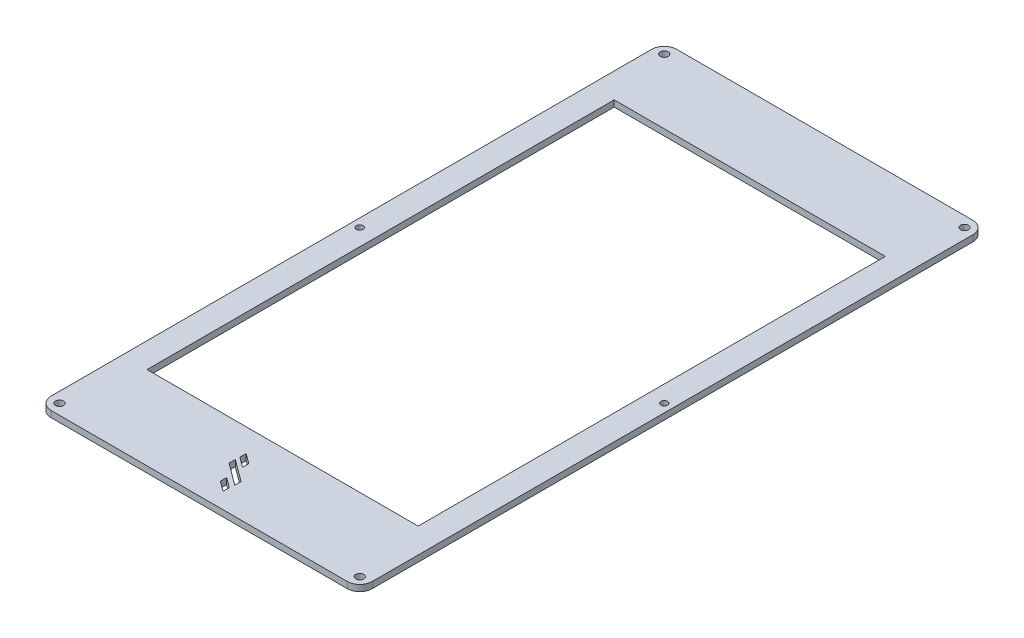
ISO-10303-21;
HEADER;
FILE_DESCRIPTION(('STEP AP214'),'2;1');
FILE_NAME('part.step','',(''),(''),'','','');
FILE_SCHEMA(('AUTOMOTIVE_DESIGN { 1 0 10303 214 1 1 1 1 }'));
ENDSEC;
DATA;
#1=APPLICATION_CONTEXT('core data for automotive mechanical design processes');
#2=APPLICATION_PROTOCOL_DEFINITION('international standard','automotive_design',2000,#1);
#3=PRODUCT_CONTEXT('',#1,'mechanical');
#4=PRODUCT('Part','Part','',(#3));
#5=PRODUCT_RELATED_PRODUCT_CATEGORY('part','',(#4));
#6=PRODUCT_DEFINITION_FORMATION('','',#4);
#7=PRODUCT_DEFINITION_CONTEXT('part definition',#1,'design');
#8=PRODUCT_DEFINITION('design','',#6,#7);
#9=PRODUCT_DEFINITION_SHAPE('','',#8);
#10=(LENGTH_UNIT() NAMED_UNIT(*) SI_UNIT(.MILLI.,.METRE.));
#11=(NAMED_UNIT(*) PLANE_ANGLE_UNIT() SI_UNIT($,.RADIAN.));
#12=(NAMED_UNIT(*) SI_UNIT($,.STERADIAN.) SOLID_ANGLE_UNIT());
#13=UNCERTAINTY_MEASURE_WITH_UNIT(LENGTH_MEASURE(1.E-05),#10,'distance_accuracy_value','');
#14=(GEOMETRIC_REPRESENTATION_CONTEXT(3) GLOBAL_UNCERTAINTY_ASSIGNED_CONTEXT((#13)) GLOBAL_UNIT_ASSIGNED_CONTEXT((#10,
#11,#12)) REPRESENTATION_CONTEXT('',''));
#15=CARTESIAN_POINT('',(0.,0.,0.));
#16=DIRECTION('',(0.,0.,1.));
#17=DIRECTION('',(1.,0.,0.));
#18=AXIS2_PLACEMENT_3D('',#15,#16,#17);
#19=CARTESIAN_POINT('',(-47.898387779286,-1.5,-1317.71353119356));
#20=DIRECTION('',(0.,-1.,0.));
#21=DIRECTION('',(0.,0.,-1.));
#22=AXIS2_PLACEMENT_3D('',#19,#20,#21);
#23=PLANE('',#22);
#24=CARTESIAN_POINT('',(-46.898387779286,-1.5,-1389.71353119356));
#25=DIRECTION('',(0.,-1.,0.));
#26=DIRECTION('',(0.,0.,-1.));
#27=AXIS2_PLACEMENT_3D('',#24,#25,#26);
#28=CIRCLE('',#27,0.799999999999977);
#29=CARTESIAN_POINT('',(-46.898387779286,-1.5,-1390.51353119356));
#30=VERTEX_POINT('',#29);
#31=EDGE_CURVE('E580',#30,#30,#28,.T.);
#32=ORIENTED_EDGE('',*,*,#31,.F.);
#33=EDGE_LOOP('',(#32));
#34=FACE_BOUND('',#33,.T.);
#35=CARTESIAN_POINT('',(-119.898387779286,-1.5,-1389.71353119356));
#36=DIRECTION('',(0.,-1.,0.));
#37=DIRECTION('',(0.,0.,1.));
#38=AXIS2_PLACEMENT_3D('',#35,#36,#37);
#39=CIRCLE('',#38,0.799999999999983);
#40=CARTESIAN_POINT('',(-119.898387779286,-1.5,-1388.91353119356));
#41=VERTEX_POINT('',#40);
#42=EDGE_CURVE('E584',#41,#41,#39,.T.);
#43=ORIENTED_EDGE('',*,*,#42,.F.);
#44=EDGE_LOOP('',(#43));
#45=FACE_BOUND('',#44,.T.);
#46=DIRECTION('',(0.,0.,-1.));
#47=VECTOR('',#46,1.);
#48=CARTESIAN_POINT('',(-50.898387779286,-1.5,-1332.71353119356));
#49=LINE('',#48,#47);
#50=CARTESIAN_POINT('',(-50.898387779286,-1.5,-1334.71353119356));
#51=VERTEX_POINT('',#50);
#52=CARTESIAN_POINT('',(-50.898387779286,-1.5,-1446.71353119356));
#53=VERTEX_POINT('',#52);
#54=EDGE_CURVE('E326',#51,#53,#49,.T.);
#55=ORIENTED_EDGE('',*,*,#54,.T.);
#56=DIRECTION('',(-1.,0.,0.));
#57=VECTOR('',#56,1.);
#58=CARTESIAN_POINT('',(-50.898387779286,-1.5,-1446.71353119356));
#59=LINE('',#58,#57);
#60=CARTESIAN_POINT('',(-115.898387779286,-1.5,-1446.71353119356));
#61=VERTEX_POINT('',#60);
#62=EDGE_CURVE('E227',#53,#61,#59,.T.);
#63=ORIENTED_EDGE('',*,*,#62,.T.);
#64=DIRECTION('',(0.,0.,-1.));
#65=VECTOR('',#64,1.);
#66=CARTESIAN_POINT('',(-115.898387779286,-1.5,-1332.71353119356));
#67=LINE('',#66,#65);
#68=CARTESIAN_POINT('',(-115.898387779286,-1.5,-1334.71353119356));
#69=VERTEX_POINT('',#68);
#70=EDGE_CURVE('E207',#69,#61,#67,.T.);
#71=ORIENTED_EDGE('',*,*,#70,.F.);
#72=DIRECTION('',(1.,0.,0.));
#73=VECTOR('',#72,1.);
#74=CARTESIAN_POINT('',(-50.898387779286,-1.5,-1334.71353119356));
#75=LINE('',#74,#73);
#76=EDGE_CURVE('E218',#69,#51,#75,.T.);
#77=ORIENTED_EDGE('',*,*,#76,.T.);
#78=EDGE_LOOP('',(#55,#63,#71,#77));
#79=FACE_BOUND('',#78,.T.);
#80=DIRECTION('',(-0.804048076479919,0.,-0.59456428643919));
#81=VECTOR('',#80,1.);
#82=CARTESIAN_POINT('',(-81.3637610941643,-1.5,-1321.20817562095));
#83=LINE('',#82,#81);
#84=CARTESIAN_POINT('',(-81.3637610941643,-1.5,-1321.20817562095));
#85=VERTEX_POINT('',#84);
#86=CARTESIAN_POINT('',(-86.6379108061744,-1.5,-1325.10821736202));
#87=VERTEX_POINT('',#86);
#88=EDGE_CURVE('E262',#85,#87,#83,.T.);
#89=ORIENTED_EDGE('',*,*,#88,.F.);
#90=DIRECTION('',(0.,0.,1.));
#91=VECTOR('',#90,1.);
#92=CARTESIAN_POINT('',(-81.3637610941643,-1.5,-1321.20817562095));
#93=LINE('',#92,#91);
#94=CARTESIAN_POINT('',(-81.3637610941643,-1.5,-1322.70950719552));
#95=VERTEX_POINT('',#94);
#96=EDGE_CURVE('E273',#95,#85,#93,.T.);
#97=ORIENTED_EDGE('',*,*,#96,.F.);
#98=DIRECTION('',(0.804048076479919,0.,0.59456428643919));
#99=VECTOR('',#98,1.);
#100=CARTESIAN_POINT('',(-81.3637610941643,-1.5,-1322.70950719552));
#101=LINE('',#100,#99);
#102=CARTESIAN_POINT('',(-86.6379108061744,-1.5,-1326.60954893659));
#103=VERTEX_POINT('',#102);
#104=EDGE_CURVE('E287',#103,#95,#101,.T.);
#105=ORIENTED_EDGE('',*,*,#104,.F.);
#106=DIRECTION('',(0.,0.,-1.));
#107=VECTOR('',#106,1.);
#108=CARTESIAN_POINT('',(-86.6379108061744,-1.5,-1325.10821736202));
#109=LINE('',#108,#107);
#110=EDGE_CURVE('E284',#87,#103,#109,.T.);
#111=ORIENTED_EDGE('',*,*,#110,.F.);
#112=EDGE_LOOP('',(#89,#97,#105,#111));
#113=FACE_BOUND('',#112,.T.);
#114=DIRECTION('',(-0.804048076479919,0.,-0.59456428643919));
#115=VECTOR('',#114,1.);
#116=CARTESIAN_POINT('',(-81.5204459504745,-1.5,-1318.54750988359));
#117=LINE('',#116,#115);
#118=CARTESIAN_POINT('',(-81.5204459504745,-1.5,-1318.54750988359));
#119=VERTEX_POINT('',#118);
#120=CARTESIAN_POINT('',(-83.9378842629742,-1.5,-1320.33511752463));
#121=VERTEX_POINT('',#120);
#122=EDGE_CURVE('E231',#119,#121,#117,.T.);
#123=ORIENTED_EDGE('',*,*,#122,.F.);
#124=DIRECTION('',(0.,0.,1.));
#125=VECTOR('',#124,1.);
#126=CARTESIAN_POINT('',(-81.5204459504745,-1.5,-1318.54750988359));
#127=LINE('',#126,#125);
#128=CARTESIAN_POINT('',(-81.5204459504745,-1.5,-1320.04884145816));
#129=VERTEX_POINT('',#128);
#130=EDGE_CURVE('E241',#129,#119,#127,.T.);
#131=ORIENTED_EDGE('',*,*,#130,.F.);
#132=DIRECTION('',(0.804048076479919,0.,0.59456428643919));
#133=VECTOR('',#132,1.);
#134=CARTESIAN_POINT('',(-81.5204459504745,-1.5,-1320.04884145816));
#135=LINE('',#134,#133);
#136=CARTESIAN_POINT('',(-83.9378842629742,-1.5,-1321.8364490992));
#137=VERTEX_POINT('',#136);
#138=EDGE_CURVE('E255',#137,#129,#135,.T.);
#139=ORIENTED_EDGE('',*,*,#138,.F.);
#140=DIRECTION('',(0.,0.,-1.));
#141=VECTOR('',#140,1.);
#142=CARTESIAN_POINT('',(-83.9378842629742,-1.5,-1320.33511752463));
#143=LINE('',#142,#141);
#144=EDGE_CURVE('E252',#121,#137,#143,.T.);
#145=ORIENTED_EDGE('',*,*,#144,.F.);
#146=EDGE_LOOP('',(#123,#131,#139,#145));
#147=FACE_BOUND('',#146,.T.);
#148=DIRECTION('',(-0.804048076479919,0.,-0.59456428643919));
#149=VECTOR('',#148,1.);
#150=CARTESIAN_POINT('',(-84.1532513743159,-1.5,-1325.85263282658));
#151=LINE('',#150,#149);
#152=CARTESIAN_POINT('',(-84.1532513743159,-1.5,-1325.85263282658));
#153=VERTEX_POINT('',#152);
#154=CARTESIAN_POINT('',(-86.5706896868156,-1.5,-1327.64024046762));
#155=VERTEX_POINT('',#154);
#156=EDGE_CURVE('E294',#153,#155,#151,.T.);
#157=ORIENTED_EDGE('',*,*,#156,.F.);
#158=DIRECTION('',(0.,0.,1.));
#159=VECTOR('',#158,1.);
#160=CARTESIAN_POINT('',(-84.1532513743159,-1.5,-1325.85263282658));
#161=LINE('',#160,#159);
#162=CARTESIAN_POINT('',(-84.1532513743159,-1.5,-1327.35396440115));
#163=VERTEX_POINT('',#162);
#164=EDGE_CURVE('E305',#163,#153,#161,.T.);
#165=ORIENTED_EDGE('',*,*,#164,.F.);
#166=DIRECTION('',(0.804048076479919,0.,0.59456428643919));
#167=VECTOR('',#166,1.);
#168=CARTESIAN_POINT('',(-84.1532513743159,-1.5,-1327.35396440115));
#169=LINE('',#168,#167);
#170=CARTESIAN_POINT('',(-86.5706896868156,-1.5,-1329.14157204219));
#171=VERTEX_POINT('',#170);
#172=EDGE_CURVE('E319',#171,#163,#169,.T.);
#173=ORIENTED_EDGE('',*,*,#172,.F.);
#174=DIRECTION('',(0.,0.,-1.));
#175=VECTOR('',#174,1.);
#176=CARTESIAN_POINT('',(-86.5706896868156,-1.5,-1327.64024046762));
#177=LINE('',#176,#175);
#178=EDGE_CURVE('E316',#155,#171,#177,.T.);
#179=ORIENTED_EDGE('',*,*,#178,.F.);
#180=EDGE_LOOP('',(#157,#165,#173,#179));
#181=FACE_BOUND('',#180,.T.);
#182=CARTESIAN_POINT('',(-47.3983877792856,-1.5,-1462.21353119356));
#183=DIRECTION('',(0.,-1.,0.));
#184=DIRECTION('',(0.,0.,-1.));
#185=AXIS2_PLACEMENT_3D('',#182,#183,#184);
#186=CIRCLE('',#185,0.950000000000017);
#187=CARTESIAN_POINT('',(-47.3983877792856,-1.5,-1463.16353119356));
#188=VERTEX_POINT('',#187);
#189=EDGE_CURVE('E372',#188,#188,#186,.T.);
#190=ORIENTED_EDGE('',*,*,#189,.F.);
#191=EDGE_LOOP('',(#190));
#192=FACE_BOUND('',#191,.T.);
#193=CARTESIAN_POINT('',(-119.398387779286,-1.5,-1462.21353119356));
#194=DIRECTION('',(0.,-1.,0.));
#195=DIRECTION('',(0.,0.,-1.));
#196=AXIS2_PLACEMENT_3D('',#193,#194,#195);
#197=CIRCLE('',#196,0.950000000000011);
#198=CARTESIAN_POINT('',(-119.398387779286,-1.5,-1463.16353119356));
#199=VERTEX_POINT('',#198);
#200=EDGE_CURVE('E378',#199,#199,#197,.T.);
#201=ORIENTED_EDGE('',*,*,#200,.F.);
#202=EDGE_LOOP('',(#201));
#203=FACE_BOUND('',#202,.T.);
#204=CARTESIAN_POINT('',(-47.898387779286,-1.5,-1317.71353119356));
#205=DIRECTION('',(0.,-1.,0.));
#206=DIRECTION('',(0.,0.,-1.));
#207=AXIS2_PLACEMENT_3D('',#204,#205,#206);
#208=CIRCLE('',#207,3.00000000000009);
#209=CARTESIAN_POINT('',(-44.8983877792859,-1.5,-1317.71353119356));
#210=VERTEX_POINT('',#209);
#211=CARTESIAN_POINT('',(-47.898387779286,-1.5,-1314.71353119356));
#212=VERTEX_POINT('',#211);
#213=EDGE_CURVE('E381',#210,#212,#208,.T.);
#214=ORIENTED_EDGE('',*,*,#213,.T.);
#215=DIRECTION('',(-1.,0.,0.));
#216=VECTOR('',#215,1.);
#217=CARTESIAN_POINT('',(-47.898387779286,-1.5,-1314.71353119356));
#218=LINE('',#217,#216);
#219=CARTESIAN_POINT('',(-118.898387779286,-1.5,-1314.71353119356));
#220=VERTEX_POINT('',#219);
#221=EDGE_CURVE('E384',#212,#220,#218,.T.);
#222=ORIENTED_EDGE('',*,*,#221,.T.);
#223=CARTESIAN_POINT('',(-118.898387779286,-1.5,-1317.71353119356));
#224=DIRECTION('',(0.,-1.,0.));
#225=DIRECTION('',(0.,0.,-1.));
#226=AXIS2_PLACEMENT_3D('',#223,#224,#225);
#227=CIRCLE('',#226,3.00000000000009);
#228=CARTESIAN_POINT('',(-121.898387779286,-1.5,-1317.71353119356));
#229=VERTEX_POINT('',#228);
#230=EDGE_CURVE('E387',#220,#229,#227,.T.);
#231=ORIENTED_EDGE('',*,*,#230,.T.);
#232=DIRECTION('',(0.,0.,-1.));
#233=VECTOR('',#232,1.);
#234=CARTESIAN_POINT('',(-121.898387779286,-1.5,-1317.71353119356));
#235=LINE('',#234,#233);
#236=CARTESIAN_POINT('',(-121.898387779286,-1.5,-1461.71353119356));
#237=VERTEX_POINT('',#236);
#238=EDGE_CURVE('E390',#229,#237,#235,.T.);
#239=ORIENTED_EDGE('',*,*,#238,.T.);
#240=CARTESIAN_POINT('',(-118.898387779286,-1.5,-1461.71353119356));
#241=DIRECTION('',(0.,-1.,0.));
#242=DIRECTION('',(0.,0.,-1.));
#243=AXIS2_PLACEMENT_3D('',#240,#241,#242);
#244=CIRCLE('',#243,2.99999999999992);
#245=CARTESIAN_POINT('',(-118.898387779286,-1.5,-1464.71353119356));
#246=VERTEX_POINT('',#245);
#247=EDGE_CURVE('E393',#237,#246,#244,.T.);
#248=ORIENTED_EDGE('',*,*,#247,.T.);
#249=DIRECTION('',(1.,0.,0.));
#250=VECTOR('',#249,1.);
#251=CARTESIAN_POINT('',(-118.898387779286,-1.5,-1464.71353119356));
#252=LINE('',#251,#250);
#253=CARTESIAN_POINT('',(-47.898387779286,-1.5,-1464.71353119356));
#254=VERTEX_POINT('',#253);
#255=EDGE_CURVE('E396',#246,#254,#252,.T.);
#256=ORIENTED_EDGE('',*,*,#255,.T.);
#257=CARTESIAN_POINT('',(-47.898387779286,-1.5,-1461.71353119356));
#258=DIRECTION('',(0.,-1.,0.));
#259=DIRECTION('',(0.,0.,-1.));
#260=AXIS2_PLACEMENT_3D('',#257,#258,#259);
#261=CIRCLE('',#260,2.99999999999992);
#262=CARTESIAN_POINT('',(-44.898387779286,-1.5,-1461.71353119356));
#263=VERTEX_POINT('',#262);
#264=EDGE_CURVE('E399',#254,#263,#261,.T.);
#265=ORIENTED_EDGE('',*,*,#264,.T.);
#266=DIRECTION('',(0.,0.,1.));
#267=VECTOR('',#266,1.);
#268=CARTESIAN_POINT('',(-44.898387779286,-1.5,-1461.71353119356));
#269=LINE('',#268,#267);
#270=EDGE_CURVE('E402',#263,#210,#269,.T.);
#271=ORIENTED_EDGE('',*,*,#270,.T.);
#272=EDGE_LOOP('',(#214,#222,#231,#239,#248,#256,#265,#271));
#273=FACE_BOUND('',#272,.T.);
#274=CARTESIAN_POINT('',(-119.398387779286,-1.5,-1317.21353119356));
#275=DIRECTION('',(0.,-1.,0.));
#276=DIRECTION('',(0.,0.,-1.));
#277=AXIS2_PLACEMENT_3D('',#274,#275,#276);
#278=CIRCLE('',#277,0.950000000000011);
#279=CARTESIAN_POINT('',(-119.398387779286,-1.5,-1318.16353119356));
#280=VERTEX_POINT('',#279);
#281=EDGE_CURVE('E375',#280,#280,#278,.T.);
#282=ORIENTED_EDGE('',*,*,#281,.F.);
#283=EDGE_LOOP('',(#282));
#284=FACE_BOUND('',#283,.T.);
#285=CARTESIAN_POINT('',(-47.398387779286,-1.5,-1317.21353119356));
#286=DIRECTION('',(0.,-1.,0.));
#287=DIRECTION('',(0.,0.,-1.));
#288=AXIS2_PLACEMENT_3D('',#285,#286,#287);
#289=CIRCLE('',#288,0.950000000000017);
#290=CARTESIAN_POINT('',(-47.398387779286,-1.5,-1318.16353119356));
#291=VERTEX_POINT('',#290);
#292=EDGE_CURVE('E369',#291,#291,#289,.T.);
#293=ORIENTED_EDGE('',*,*,#292,.F.);
#294=EDGE_LOOP('',(#293));
#295=FACE_BOUND('',#294,.T.);
#296=ADVANCED_FACE('F38',(#34,#45,#79,#113,#147,#181,#192,#203,#273,#284,#295),#23,.T.);
#297=CARTESIAN_POINT('',(-47.898387779286,0.,-1317.71353119356));
#298=DIRECTION('',(0.,-1.,0.));
#299=DIRECTION('',(0.,0.,-1.));
#300=AXIS2_PLACEMENT_3D('',#297,#298,#299);
#301=PLANE('',#300);
#302=CARTESIAN_POINT('',(-46.898387779286,0.,-1389.71353119356));
#303=DIRECTION('',(0.,-1.,0.));
#304=DIRECTION('',(0.,0.,-1.));
#305=AXIS2_PLACEMENT_3D('',#302,#303,#304);
#306=CIRCLE('',#305,0.799999999999977);
#307=CARTESIAN_POINT('',(-46.898387779286,0.,-1390.51353119356));
#308=VERTEX_POINT('',#307);
#309=EDGE_CURVE('E228',#308,#308,#306,.F.);
#310=ORIENTED_EDGE('',*,*,#309,.F.);
#311=EDGE_LOOP('',(#310));
#312=FACE_BOUND('',#311,.T.);
#313=CARTESIAN_POINT('',(-119.898387779286,0.,-1389.71353119356));
#314=DIRECTION('',(0.,-1.,0.));
#315=DIRECTION('',(0.,0.,-1.));
#316=AXIS2_PLACEMENT_3D('',#313,#314,#315);
#317=CIRCLE('',#316,0.799999999999983);
#318=CARTESIAN_POINT('',(-119.898387779286,0.,-1390.51353119356));
#319=VERTEX_POINT('',#318);
#320=EDGE_CURVE('E225',#319,#319,#317,.F.);
#321=ORIENTED_EDGE('',*,*,#320,.F.);
#322=EDGE_LOOP('',(#321));
#323=FACE_BOUND('',#322,.T.);
#324=DIRECTION('',(1.,0.,0.));
#325=VECTOR('',#324,1.);
#326=CARTESIAN_POINT('',(-50.898387779286,0.,-1446.71353119356));
#327=LINE('',#326,#325);
#328=CARTESIAN_POINT('',(-115.898387779286,0.,-1446.71353119356));
#329=VERTEX_POINT('',#328);
#330=CARTESIAN_POINT('',(-50.898387779286,0.,-1446.71353119356));
#331=VERTEX_POINT('',#330);
#332=EDGE_CURVE('E202',#329,#331,#327,.T.);
#333=ORIENTED_EDGE('',*,*,#332,.T.);
#334=DIRECTION('',(0.,0.,1.));
#335=VECTOR('',#334,1.);
#336=CARTESIAN_POINT('',(-50.898387779286,0.,-1332.71353119356));
#337=LINE('',#336,#335);
#338=CARTESIAN_POINT('',(-50.898387779286,0.,-1334.71353119356));
#339=VERTEX_POINT('',#338);
#340=EDGE_CURVE('E59',#331,#339,#337,.T.);
#341=ORIENTED_EDGE('',*,*,#340,.T.);
#342=DIRECTION('',(-1.,0.,0.));
#343=VECTOR('',#342,1.);
#344=CARTESIAN_POINT('',(-50.898387779286,0.,-1334.71353119356));
#345=LINE('',#344,#343);
#346=CARTESIAN_POINT('',(-115.898387779286,0.,-1334.71353119356));
#347=VERTEX_POINT('',#346);
#348=EDGE_CURVE('E204',#339,#347,#345,.T.);
#349=ORIENTED_EDGE('',*,*,#348,.T.);
#350=DIRECTION('',(0.,0.,1.));
#351=VECTOR('',#350,1.);
#352=CARTESIAN_POINT('',(-115.898387779286,0.,-1332.71353119356));
#353=LINE('',#352,#351);
#354=EDGE_CURVE('E197',#329,#347,#353,.T.);
#355=ORIENTED_EDGE('',*,*,#354,.F.);
#356=EDGE_LOOP('',(#333,#341,#349,#355));
#357=FACE_BOUND('',#356,.T.);
#358=DIRECTION('',(0.,0.,1.));
#359=VECTOR('',#358,1.);
#360=CARTESIAN_POINT('',(-81.3637610941643,0.,-1321.20817562095));
#361=LINE('',#360,#359);
#362=CARTESIAN_POINT('',(-81.3637610941643,0.,-1322.70950719552));
#363=VERTEX_POINT('',#362);
#364=CARTESIAN_POINT('',(-81.3637610941643,0.,-1321.20817562095));
#365=VERTEX_POINT('',#364);
#366=EDGE_CURVE('E279',#363,#365,#361,.T.);
#367=ORIENTED_EDGE('',*,*,#366,.T.);
#368=DIRECTION('',(-0.804048076479919,0.,-0.59456428643919));
#369=VECTOR('',#368,1.);
#370=CARTESIAN_POINT('',(-81.3637610941643,0.,-1321.20817562095));
#371=LINE('',#370,#369);
#372=CARTESIAN_POINT('',(-86.6379108061744,0.,-1325.10821736202));
#373=VERTEX_POINT('',#372);
#374=EDGE_CURVE('E269',#365,#373,#371,.T.);
#375=ORIENTED_EDGE('',*,*,#374,.T.);
#376=DIRECTION('',(0.,0.,-1.));
#377=VECTOR('',#376,1.);
#378=CARTESIAN_POINT('',(-86.6379108061744,0.,-1325.10821736202));
#379=LINE('',#378,#377);
#380=CARTESIAN_POINT('',(-86.6379108061744,0.,-1326.60954893659));
#381=VERTEX_POINT('',#380);
#382=EDGE_CURVE('E272',#373,#381,#379,.T.);
#383=ORIENTED_EDGE('',*,*,#382,.T.);
#384=DIRECTION('',(0.804048076479919,0.,0.59456428643919));
#385=VECTOR('',#384,1.);
#386=CARTESIAN_POINT('',(-81.3637610941643,0.,-1322.70950719552));
#387=LINE('',#386,#385);
#388=EDGE_CURVE('E276',#381,#363,#387,.T.);
#389=ORIENTED_EDGE('',*,*,#388,.T.);
#390=EDGE_LOOP('',(#367,#375,#383,#389));
#391=FACE_BOUND('',#390,.T.);
#392=DIRECTION('',(0.,0.,1.));
#393=VECTOR('',#392,1.);
#394=CARTESIAN_POINT('',(-81.5204459504745,0.,-1318.54750988359));
#395=LINE('',#394,#393);
#396=CARTESIAN_POINT('',(-81.5204459504745,0.,-1320.04884145816));
#397=VERTEX_POINT('',#396);
#398=CARTESIAN_POINT('',(-81.5204459504745,0.,-1318.54750988359));
#399=VERTEX_POINT('',#398);
#400=EDGE_CURVE('E247',#397,#399,#395,.T.);
#401=ORIENTED_EDGE('',*,*,#400,.T.);
#402=DIRECTION('',(-0.804048076479919,0.,-0.59456428643919));
#403=VECTOR('',#402,1.);
#404=CARTESIAN_POINT('',(-81.5204459504745,0.,-1318.54750988359));
#405=LINE('',#404,#403);
#406=CARTESIAN_POINT('',(-83.9378842629742,0.,-1320.33511752463));
#407=VERTEX_POINT('',#406);
#408=EDGE_CURVE('E237',#399,#407,#405,.T.);
#409=ORIENTED_EDGE('',*,*,#408,.T.);
#410=DIRECTION('',(0.,0.,-1.));
#411=VECTOR('',#410,1.);
#412=CARTESIAN_POINT('',(-83.9378842629742,0.,-1320.33511752463));
#413=LINE('',#412,#411);
#414=CARTESIAN_POINT('',(-83.9378842629742,0.,-1321.8364490992));
#415=VERTEX_POINT('',#414);
#416=EDGE_CURVE('E240',#407,#415,#413,.T.);
#417=ORIENTED_EDGE('',*,*,#416,.T.);
#418=DIRECTION('',(0.804048076479919,0.,0.59456428643919));
#419=VECTOR('',#418,1.);
#420=CARTESIAN_POINT('',(-81.5204459504745,0.,-1320.04884145816));
#421=LINE('',#420,#419);
#422=EDGE_CURVE('E244',#415,#397,#421,.T.);
#423=ORIENTED_EDGE('',*,*,#422,.T.);
#424=EDGE_LOOP('',(#401,#409,#417,#423));
#425=FACE_BOUND('',#424,.T.);
#426=DIRECTION('',(0.,0.,1.));
#427=VECTOR('',#426,1.);
#428=CARTESIAN_POINT('',(-84.1532513743159,0.,-1325.85263282658));
#429=LINE('',#428,#427);
#430=CARTESIAN_POINT('',(-84.1532513743159,0.,-1327.35396440115));
#431=VERTEX_POINT('',#430);
#432=CARTESIAN_POINT('',(-84.1532513743159,0.,-1325.85263282658));
#433=VERTEX_POINT('',#432);
#434=EDGE_CURVE('E311',#431,#433,#429,.T.);
#435=ORIENTED_EDGE('',*,*,#434,.T.);
#436=DIRECTION('',(-0.804048076479919,0.,-0.59456428643919));
#437=VECTOR('',#436,1.);
#438=CARTESIAN_POINT('',(-84.1532513743159,0.,-1325.85263282658));
#439=LINE('',#438,#437);
#440=CARTESIAN_POINT('',(-86.5706896868156,0.,-1327.64024046762));
#441=VERTEX_POINT('',#440);
#442=EDGE_CURVE('E301',#433,#441,#439,.T.);
#443=ORIENTED_EDGE('',*,*,#442,.T.);
#444=DIRECTION('',(0.,0.,-1.));
#445=VECTOR('',#444,1.);
#446=CARTESIAN_POINT('',(-86.5706896868156,0.,-1327.64024046762));
#447=LINE('',#446,#445);
#448=CARTESIAN_POINT('',(-86.5706896868156,0.,-1329.14157204219));
#449=VERTEX_POINT('',#448);
#450=EDGE_CURVE('E304',#441,#449,#447,.T.);
#451=ORIENTED_EDGE('',*,*,#450,.T.);
#452=DIRECTION('',(0.804048076479919,0.,0.59456428643919));
#453=VECTOR('',#452,1.);
#454=CARTESIAN_POINT('',(-84.1532513743159,0.,-1327.35396440115));
#455=LINE('',#454,#453);
#456=EDGE_CURVE('E308',#449,#431,#455,.T.);
#457=ORIENTED_EDGE('',*,*,#456,.T.);
#458=EDGE_LOOP('',(#435,#443,#451,#457));
#459=FACE_BOUND('',#458,.T.);
#460=DIRECTION('',(0.,0.,1.));
#461=VECTOR('',#460,1.);
#462=CARTESIAN_POINT('',(-44.898387779286,0.,-1461.71353119356));
#463=LINE('',#462,#461);
#464=CARTESIAN_POINT('',(-44.898387779286,0.,-1461.71353119356));
#465=VERTEX_POINT('',#464);
#466=CARTESIAN_POINT('',(-44.898387779286,0.,-1317.71353119356));
#467=VERTEX_POINT('',#466);
#468=EDGE_CURVE('E363',#465,#467,#463,.T.);
#469=ORIENTED_EDGE('',*,*,#468,.F.);
#470=CARTESIAN_POINT('',(-47.898387779286,0.,-1461.71353119356));
#471=DIRECTION('',(0.,-1.,0.));
#472=DIRECTION('',(0.,0.,-1.));
#473=AXIS2_PLACEMENT_3D('',#470,#471,#472);
#474=CIRCLE('',#473,2.99999999999995);
#475=CARTESIAN_POINT('',(-47.898387779286,0.,-1464.71353119356));
#476=VERTEX_POINT('',#475);
#477=EDGE_CURVE('E360',#476,#465,#474,.T.);
#478=ORIENTED_EDGE('',*,*,#477,.F.);
#479=DIRECTION('',(1.,0.,0.));
#480=VECTOR('',#479,1.);
#481=CARTESIAN_POINT('',(-118.898387779286,0.,-1464.71353119356));
#482=LINE('',#481,#480);
#483=CARTESIAN_POINT('',(-118.898387779286,0.,-1464.71353119356));
#484=VERTEX_POINT('',#483);
#485=EDGE_CURVE('E357',#484,#476,#482,.T.);
#486=ORIENTED_EDGE('',*,*,#485,.F.);
#487=CARTESIAN_POINT('',(-118.898387779286,0.,-1461.71353119356));
#488=DIRECTION('',(0.,-1.,0.));
#489=DIRECTION('',(0.,0.,-1.));
#490=AXIS2_PLACEMENT_3D('',#487,#488,#489);
#491=CIRCLE('',#490,2.99999999999995);
#492=CARTESIAN_POINT('',(-121.898387779286,0.,-1461.71353119356));
#493=VERTEX_POINT('',#492);
#494=EDGE_CURVE('E354',#493,#484,#491,.T.);
#495=ORIENTED_EDGE('',*,*,#494,.F.);
#496=DIRECTION('',(0.,0.,-1.));
#497=VECTOR('',#496,1.);
#498=CARTESIAN_POINT('',(-121.898387779286,0.,-1461.71353119356));
#499=LINE('',#498,#497);
#500=CARTESIAN_POINT('',(-121.898387779286,0.,-1317.71353119356));
#501=VERTEX_POINT('',#500);
#502=EDGE_CURVE('E351',#501,#493,#499,.T.);
#503=ORIENTED_EDGE('',*,*,#502,.F.);
#504=CARTESIAN_POINT('',(-118.898387779286,0.,-1317.71353119356));
#505=DIRECTION('',(0.,-1.,0.));
#506=DIRECTION('',(0.,0.,-1.));
#507=AXIS2_PLACEMENT_3D('',#504,#505,#506);
#508=CIRCLE('',#507,3.00000000000006);
#509=CARTESIAN_POINT('',(-118.898387779286,0.,-1314.71353119356));
#510=VERTEX_POINT('',#509);
#511=EDGE_CURVE('E348',#510,#501,#508,.T.);
#512=ORIENTED_EDGE('',*,*,#511,.F.);
#513=DIRECTION('',(-1.,0.,0.));
#514=VECTOR('',#513,1.);
#515=CARTESIAN_POINT('',(-118.898387779286,0.,-1314.71353119356));
#516=LINE('',#515,#514);
#517=CARTESIAN_POINT('',(-47.898387779286,0.,-1314.71353119356));
#518=VERTEX_POINT('',#517);
#519=EDGE_CURVE('E345',#518,#510,#516,.T.);
#520=ORIENTED_EDGE('',*,*,#519,.F.);
#521=CARTESIAN_POINT('',(-47.898387779286,0.,-1317.71353119356));
#522=DIRECTION('',(0.,-1.,0.));
#523=DIRECTION('',(0.,0.,-1.));
#524=AXIS2_PLACEMENT_3D('',#521,#522,#523);
#525=CIRCLE('',#524,3.00000000000007);
#526=EDGE_CURVE('E366',#467,#518,#525,.T.);
#527=ORIENTED_EDGE('',*,*,#526,.F.);
#528=EDGE_LOOP('',(#469,#478,#486,#495,#503,#512,#520,#527));
#529=FACE_BOUND('',#528,.T.);
#530=CARTESIAN_POINT('',(-47.3983877792856,0.,-1462.21353119356));
#531=DIRECTION('',(0.,-1.,0.));
#532=DIRECTION('',(0.,0.,-1.));
#533=AXIS2_PLACEMENT_3D('',#530,#531,#532);
#534=CIRCLE('',#533,0.950000000000031);
#535=CARTESIAN_POINT('',(-47.3983877792856,0.,-1463.16353119356));
#536=VERTEX_POINT('',#535);
#537=EDGE_CURVE('E339',#536,#536,#534,.F.);
#538=ORIENTED_EDGE('',*,*,#537,.F.);
#539=EDGE_LOOP('',(#538));
#540=FACE_BOUND('',#539,.T.);
#541=CARTESIAN_POINT('',(-119.398387779286,0.,-1317.21353119356));
#542=DIRECTION('',(0.,-1.,0.));
#543=DIRECTION('',(0.,0.,-1.));
#544=AXIS2_PLACEMENT_3D('',#541,#542,#543);
#545=CIRCLE('',#544,0.950000000000024);
#546=CARTESIAN_POINT('',(-119.398387779286,0.,-1318.16353119356));
#547=VERTEX_POINT('',#546);
#548=EDGE_CURVE('E42',#547,#547,#545,.F.);
#549=ORIENTED_EDGE('',*,*,#548,.F.);
#550=EDGE_LOOP('',(#549));
#551=FACE_BOUND('',#550,.T.);
#552=CARTESIAN_POINT('',(-47.398387779286,0.,-1317.21353119356));
#553=DIRECTION('',(0.,-1.,0.));
#554=DIRECTION('',(0.,0.,-1.));
#555=AXIS2_PLACEMENT_3D('',#552,#553,#554);
#556=CIRCLE('',#555,0.950000000000024);
#557=CARTESIAN_POINT('',(-47.398387779286,0.,-1318.16353119356));
#558=VERTEX_POINT('',#557);
#559=EDGE_CURVE('E336',#558,#558,#556,.F.);
#560=ORIENTED_EDGE('',*,*,#559,.F.);
#561=EDGE_LOOP('',(#560));
#562=FACE_BOUND('',#561,.T.);
#563=CARTESIAN_POINT('',(-119.398387779286,0.,-1462.21353119356));
#564=DIRECTION('',(0.,-1.,0.));
#565=DIRECTION('',(0.,0.,-1.));
#566=AXIS2_PLACEMENT_3D('',#563,#564,#565);
#567=CIRCLE('',#566,0.950000000000024);
#568=CARTESIAN_POINT('',(-119.398387779286,0.,-1463.16353119356));
#569=VERTEX_POINT('',#568);
#570=EDGE_CURVE('E342',#569,#569,#567,.F.);
#571=ORIENTED_EDGE('',*,*,#570,.F.);
#572=EDGE_LOOP('',(#571));
#573=FACE_BOUND('',#572,.T.);
#574=ADVANCED_FACE('F199',(#312,#323,#357,#391,#425,#459,#529,#540,#551,#562,#573),#301,.F.);
#575=CARTESIAN_POINT('',(-47.398387779286,10.,-1317.21353119356));
#576=DIRECTION('',(0.,-1.,0.));
#577=DIRECTION('',(0.,0.,-1.));
#578=AXIS2_PLACEMENT_3D('',#575,#576,#577);
#579=CYLINDRICAL_SURFACE('',#578,0.950000000000024);
#580=ORIENTED_EDGE('',*,*,#559,.T.);
#581=EDGE_LOOP('',(#580));
#582=FACE_BOUND('',#581,.T.);
#583=ORIENTED_EDGE('',*,*,#292,.T.);
#584=EDGE_LOOP('',(#583));
#585=FACE_BOUND('',#584,.T.);
#586=ADVANCED_FACE('F453',(#582,#585),#579,.F.);
#587=CARTESIAN_POINT('',(-118.898387779286,15.,-1314.71353119356));
#588=DIRECTION('',(0.,0.,-1.));
#589=DIRECTION('',(-1.,0.,0.));
#590=AXIS2_PLACEMENT_3D('',#587,#588,#589);
#591=PLANE('',#590);
#592=DIRECTION('',(0.,-1.,0.));
#593=VECTOR('',#592,1.);
#594=CARTESIAN_POINT('',(-47.898387779286,15.,-1314.71353119356));
#595=LINE('',#594,#593);
#596=EDGE_CURVE('E405',#518,#212,#595,.T.);
#597=ORIENTED_EDGE('',*,*,#596,.F.);
#598=ORIENTED_EDGE('',*,*,#519,.T.);
#599=DIRECTION('',(0.,-1.,0.));
#600=VECTOR('',#599,1.);
#601=CARTESIAN_POINT('',(-118.898387779286,15.,-1314.71353119356));
#602=LINE('',#601,#600);
#603=EDGE_CURVE('E407',#510,#220,#602,.T.);
#604=ORIENTED_EDGE('',*,*,#603,.T.);
#605=ORIENTED_EDGE('',*,*,#221,.F.);
#606=EDGE_LOOP('',(#597,#598,#604,#605));
#607=FACE_BOUND('',#606,.T.);
#608=ADVANCED_FACE('F451',(#607),#591,.F.);
#609=CARTESIAN_POINT('',(-118.898387779286,15.,-1317.71353119356));
#610=DIRECTION('',(0.,-1.,0.));
#611=DIRECTION('',(0.,0.,-1.));
#612=AXIS2_PLACEMENT_3D('',#609,#610,#611);
#613=CYLINDRICAL_SURFACE('',#612,3.00000000000006);
#614=ORIENTED_EDGE('',*,*,#603,.F.);
#615=ORIENTED_EDGE('',*,*,#511,.T.);
#616=DIRECTION('',(0.,-1.,0.));
#617=VECTOR('',#616,1.);
#618=CARTESIAN_POINT('',(-121.898387779286,15.,-1317.71353119356));
#619=LINE('',#618,#617);
#620=EDGE_CURVE('E409',#501,#229,#619,.T.);
#621=ORIENTED_EDGE('',*,*,#620,.T.);
#622=ORIENTED_EDGE('',*,*,#230,.F.);
#623=EDGE_LOOP('',(#614,#615,#621,#622));
#624=FACE_BOUND('',#623,.T.);
#625=ADVANCED_FACE('F438',(#624),#613,.T.);
#626=CARTESIAN_POINT('',(-121.898387779286,15.,-1461.71353119356));
#627=DIRECTION('',(1.,0.,0.));
#628=DIRECTION('',(0.,0.,-1.));
#629=AXIS2_PLACEMENT_3D('',#626,#627,#628);
#630=PLANE('',#629);
#631=ORIENTED_EDGE('',*,*,#620,.F.);
#632=ORIENTED_EDGE('',*,*,#502,.T.);
#633=DIRECTION('',(0.,-1.,0.));
#634=VECTOR('',#633,1.);
#635=CARTESIAN_POINT('',(-121.898387779286,15.,-1461.71353119356));
#636=LINE('',#635,#634);
#637=EDGE_CURVE('E411',#493,#237,#636,.T.);
#638=ORIENTED_EDGE('',*,*,#637,.T.);
#639=ORIENTED_EDGE('',*,*,#238,.F.);
#640=EDGE_LOOP('',(#631,#632,#638,#639));
#641=FACE_BOUND('',#640,.T.);
#642=ADVANCED_FACE('F441',(#641),#630,.F.);
#643=CARTESIAN_POINT('',(-118.898387779286,15.,-1461.71353119356));
#644=DIRECTION('',(0.,-1.,0.));
#645=DIRECTION('',(0.,0.,-1.));
#646=AXIS2_PLACEMENT_3D('',#643,#644,#645);
#647=CYLINDRICAL_SURFACE('',#646,2.99999999999995);
#648=ORIENTED_EDGE('',*,*,#637,.F.);
#649=ORIENTED_EDGE('',*,*,#494,.T.);
#650=DIRECTION('',(0.,-1.,0.));
#651=VECTOR('',#650,1.);
#652=CARTESIAN_POINT('',(-118.898387779286,15.,-1464.71353119356));
#653=LINE('',#652,#651);
#654=EDGE_CURVE('E413',#484,#246,#653,.T.);
#655=ORIENTED_EDGE('',*,*,#654,.T.);
#656=ORIENTED_EDGE('',*,*,#247,.F.);
#657=EDGE_LOOP('',(#648,#649,#655,#656));
#658=FACE_BOUND('',#657,.T.);
#659=ADVANCED_FACE('F445',(#658),#647,.T.);
#660=CARTESIAN_POINT('',(-118.898387779286,15.,-1464.71353119356));
#661=DIRECTION('',(0.,0.,1.));
#662=DIRECTION('',(1.,0.,0.));
#663=AXIS2_PLACEMENT_3D('',#660,#661,#662);
#664=PLANE('',#663);
#665=ORIENTED_EDGE('',*,*,#654,.F.);
#666=ORIENTED_EDGE('',*,*,#485,.T.);
#667=DIRECTION('',(0.,-1.,0.));
#668=VECTOR('',#667,1.);
#669=CARTESIAN_POINT('',(-47.898387779286,15.,-1464.71353119356));
#670=LINE('',#669,#668);
#671=EDGE_CURVE('E415',#476,#254,#670,.T.);
#672=ORIENTED_EDGE('',*,*,#671,.T.);
#673=ORIENTED_EDGE('',*,*,#255,.F.);
#674=EDGE_LOOP('',(#665,#666,#672,#673));
#675=FACE_BOUND('',#674,.T.);
#676=ADVANCED_FACE('F448',(#675),#664,.F.);
#677=CARTESIAN_POINT('',(-47.898387779286,15.,-1461.71353119356));
#678=DIRECTION('',(0.,-1.,0.));
#679=DIRECTION('',(0.,0.,-1.));
#680=AXIS2_PLACEMENT_3D('',#677,#678,#679);
#681=CYLINDRICAL_SURFACE('',#680,2.99999999999995);
#682=ORIENTED_EDGE('',*,*,#671,.F.);
#683=ORIENTED_EDGE('',*,*,#477,.T.);
#684=DIRECTION('',(0.,-1.,0.));
#685=VECTOR('',#684,1.);
#686=CARTESIAN_POINT('',(-44.898387779286,15.,-1461.71353119356));
#687=LINE('',#686,#685);
#688=EDGE_CURVE('E47',#465,#263,#687,.T.);
#689=ORIENTED_EDGE('',*,*,#688,.T.);
#690=ORIENTED_EDGE('',*,*,#264,.F.);
#691=EDGE_LOOP('',(#682,#683,#689,#690));
#692=FACE_BOUND('',#691,.T.);
#693=ADVANCED_FACE('F421',(#692),#681,.T.);
#694=CARTESIAN_POINT('',(-44.898387779286,15.,-1461.71353119356));
#695=DIRECTION('',(-1.,0.,0.));
#696=DIRECTION('',(0.,0.,1.));
#697=AXIS2_PLACEMENT_3D('',#694,#695,#696);
#698=PLANE('',#697);
#699=ORIENTED_EDGE('',*,*,#688,.F.);
#700=ORIENTED_EDGE('',*,*,#468,.T.);
#701=DIRECTION('',(0.,-1.,0.));
#702=VECTOR('',#701,1.);
#703=CARTESIAN_POINT('',(-44.898387779286,15.,-1317.71353119356));
#704=LINE('',#703,#702);
#705=EDGE_CURVE('E12',#467,#210,#704,.T.);
#706=ORIENTED_EDGE('',*,*,#705,.T.);
#707=ORIENTED_EDGE('',*,*,#270,.F.);
#708=EDGE_LOOP('',(#699,#700,#706,#707));
#709=FACE_BOUND('',#708,.T.);
#710=ADVANCED_FACE('F428',(#709),#698,.F.);
#711=CARTESIAN_POINT('',(-47.898387779286,15.,-1317.71353119356));
#712=DIRECTION('',(0.,-1.,0.));
#713=DIRECTION('',(0.,0.,-1.));
#714=AXIS2_PLACEMENT_3D('',#711,#712,#713);
#715=CYLINDRICAL_SURFACE('',#714,3.00000000000007);
#716=ORIENTED_EDGE('',*,*,#705,.F.);
#717=ORIENTED_EDGE('',*,*,#526,.T.);
#718=ORIENTED_EDGE('',*,*,#596,.T.);
#719=ORIENTED_EDGE('',*,*,#213,.F.);
#720=EDGE_LOOP('',(#716,#717,#718,#719));
#721=FACE_BOUND('',#720,.T.);
#722=ADVANCED_FACE('F40',(#721),#715,.T.);
#723=CARTESIAN_POINT('',(-119.398387779286,10.,-1462.21353119356));
#724=DIRECTION('',(0.,-1.,0.));
#725=DIRECTION('',(0.,0.,-1.));
#726=AXIS2_PLACEMENT_3D('',#723,#724,#725);
#727=CYLINDRICAL_SURFACE('',#726,0.950000000000024);
#728=ORIENTED_EDGE('',*,*,#570,.T.);
#729=EDGE_LOOP('',(#728));
#730=FACE_BOUND('',#729,.T.);
#731=ORIENTED_EDGE('',*,*,#200,.T.);
#732=EDGE_LOOP('',(#731));
#733=FACE_BOUND('',#732,.T.);
#734=ADVANCED_FACE('F481',(#730,#733),#727,.F.);
#735=CARTESIAN_POINT('',(-47.3983877792856,10.,-1462.21353119356));
#736=DIRECTION('',(0.,-1.,0.));
#737=DIRECTION('',(0.,0.,-1.));
#738=AXIS2_PLACEMENT_3D('',#735,#736,#737);
#739=CYLINDRICAL_SURFACE('',#738,0.950000000000031);
#740=ORIENTED_EDGE('',*,*,#537,.T.);
#741=EDGE_LOOP('',(#740));
#742=FACE_BOUND('',#741,.T.);
#743=ORIENTED_EDGE('',*,*,#189,.T.);
#744=EDGE_LOOP('',(#743));
#745=FACE_BOUND('',#744,.T.);
#746=ADVANCED_FACE('F477',(#742,#745),#739,.F.);
#747=CARTESIAN_POINT('',(-119.398387779286,10.,-1317.21353119356));
#748=DIRECTION('',(0.,-1.,0.));
#749=DIRECTION('',(0.,0.,-1.));
#750=AXIS2_PLACEMENT_3D('',#747,#748,#749);
#751=CYLINDRICAL_SURFACE('',#750,0.950000000000024);
#752=ORIENTED_EDGE('',*,*,#548,.T.);
#753=EDGE_LOOP('',(#752));
#754=FACE_BOUND('',#753,.T.);
#755=ORIENTED_EDGE('',*,*,#281,.T.);
#756=EDGE_LOOP('',(#755));
#757=FACE_BOUND('',#756,.T.);
#758=ADVANCED_FACE('F480',(#754,#757),#751,.F.);
#759=CARTESIAN_POINT('',(-50.898387779286,132.969921410821,-1332.71353119356));
#760=DIRECTION('',(-1.,0.,0.));
#761=DIRECTION('',(0.,0.,1.));
#762=AXIS2_PLACEMENT_3D('',#759,#760,#761);
#763=PLANE('',#762);
#764=DIRECTION('',(0.,-1.,0.));
#765=VECTOR('',#764,1.);
#766=CARTESIAN_POINT('',(-50.898387779286,65.0307619515564,-1446.71353119356));
#767=LINE('',#766,#765);
#768=EDGE_CURVE('E54',#331,#53,#767,.T.);
#769=ORIENTED_EDGE('',*,*,#768,.T.);
#770=ORIENTED_EDGE('',*,*,#54,.F.);
#771=DIRECTION('',(0.,-1.,0.));
#772=VECTOR('',#771,1.);
#773=CARTESIAN_POINT('',(-50.898387779286,65.0307619515564,-1334.71353119356));
#774=LINE('',#773,#772);
#775=EDGE_CURVE('E232',#339,#51,#774,.T.);
#776=ORIENTED_EDGE('',*,*,#775,.F.);
#777=ORIENTED_EDGE('',*,*,#340,.F.);
#778=EDGE_LOOP('',(#769,#770,#776,#777));
#779=FACE_BOUND('',#778,.T.);
#780=ADVANCED_FACE('F474',(#779),#763,.T.);
#781=CARTESIAN_POINT('',(-115.898387779286,132.969921410821,-1332.71353119356));
#782=DIRECTION('',(-1.,0.,0.));
#783=DIRECTION('',(0.,0.,1.));
#784=AXIS2_PLACEMENT_3D('',#781,#782,#783);
#785=PLANE('',#784);
#786=ORIENTED_EDGE('',*,*,#70,.T.);
#787=DIRECTION('',(0.,-1.,0.));
#788=VECTOR('',#787,1.);
#789=CARTESIAN_POINT('',(-115.898387779286,65.0307619515564,-1446.71353119356));
#790=LINE('',#789,#788);
#791=EDGE_CURVE('E210',#329,#61,#790,.T.);
#792=ORIENTED_EDGE('',*,*,#791,.F.);
#793=ORIENTED_EDGE('',*,*,#354,.T.);
#794=DIRECTION('',(0.,-1.,0.));
#795=VECTOR('',#794,1.);
#796=CARTESIAN_POINT('',(-115.898387779286,65.0307619515564,-1334.71353119356));
#797=LINE('',#796,#795);
#798=EDGE_CURVE('E221',#347,#69,#797,.T.);
#799=ORIENTED_EDGE('',*,*,#798,.T.);
#800=EDGE_LOOP('',(#786,#792,#793,#799));
#801=FACE_BOUND('',#800,.T.);
#802=ADVANCED_FACE('F211',(#801),#785,.F.);
#803=CARTESIAN_POINT('',(-84.1532513743159,0.,-1325.85263282658));
#804=DIRECTION('',(-0.59456428643919,0.,0.804048076479919));
#805=DIRECTION('',(0.804048076479919,0.,0.59456428643919));
#806=AXIS2_PLACEMENT_3D('',#803,#804,#805);
#807=PLANE('',#806);
#808=ORIENTED_EDGE('',*,*,#156,.T.);
#809=DIRECTION('',(0.,-1.,0.));
#810=VECTOR('',#809,1.);
#811=CARTESIAN_POINT('',(-86.5706896868156,0.,-1327.64024046762));
#812=LINE('',#811,#810);
#813=EDGE_CURVE('E314',#441,#155,#812,.T.);
#814=ORIENTED_EDGE('',*,*,#813,.F.);
#815=ORIENTED_EDGE('',*,*,#442,.F.);
#816=DIRECTION('',(0.,-1.,0.));
#817=VECTOR('',#816,1.);
#818=CARTESIAN_POINT('',(-84.1532513743159,0.,-1325.85263282658));
#819=LINE('',#818,#817);
#820=EDGE_CURVE('E324',#433,#153,#819,.T.);
#821=ORIENTED_EDGE('',*,*,#820,.T.);
#822=EDGE_LOOP('',(#808,#814,#815,#821));
#823=FACE_BOUND('',#822,.T.);
#824=ADVANCED_FACE('F510',(#823),#807,.F.);
#825=CARTESIAN_POINT('',(-84.1532513743159,0.,-1325.85263282658));
#826=DIRECTION('',(1.,0.,0.));
#827=DIRECTION('',(0.,0.,-1.));
#828=AXIS2_PLACEMENT_3D('',#825,#826,#827);
#829=PLANE('',#828);
#830=ORIENTED_EDGE('',*,*,#164,.T.);
#831=ORIENTED_EDGE('',*,*,#820,.F.);
#832=ORIENTED_EDGE('',*,*,#434,.F.);
#833=DIRECTION('',(0.,-1.,0.));
#834=VECTOR('',#833,1.);
#835=CARTESIAN_POINT('',(-84.1532513743159,0.,-1327.35396440115));
#836=LINE('',#835,#834);
#837=EDGE_CURVE('E327',#431,#163,#836,.T.);
#838=ORIENTED_EDGE('',*,*,#837,.T.);
#839=EDGE_LOOP('',(#830,#831,#832,#838));
#840=FACE_BOUND('',#839,.T.);
#841=ADVANCED_FACE('F515',(#840),#829,.F.);
#842=CARTESIAN_POINT('',(-84.1532513743159,0.,-1327.35396440115));
#843=DIRECTION('',(0.59456428643919,0.,-0.804048076479919));
#844=DIRECTION('',(-0.804048076479919,0.,-0.59456428643919));
#845=AXIS2_PLACEMENT_3D('',#842,#843,#844);
#846=PLANE('',#845);
#847=ORIENTED_EDGE('',*,*,#172,.T.);
#848=ORIENTED_EDGE('',*,*,#837,.F.);
#849=ORIENTED_EDGE('',*,*,#456,.F.);
#850=DIRECTION('',(0.,-1.,0.));
#851=VECTOR('',#850,1.);
#852=CARTESIAN_POINT('',(-86.5706896868156,0.,-1329.14157204219));
#853=LINE('',#852,#851);
#854=EDGE_CURVE('E329',#449,#171,#853,.T.);
#855=ORIENTED_EDGE('',*,*,#854,.T.);
#856=EDGE_LOOP('',(#847,#848,#849,#855));
#857=FACE_BOUND('',#856,.T.);
#858=ADVANCED_FACE('F523',(#857),#846,.F.);
#859=CARTESIAN_POINT('',(-86.5706896868156,0.,-1327.64024046762));
#860=DIRECTION('',(-1.,0.,0.));
#861=DIRECTION('',(0.,0.,1.));
#862=AXIS2_PLACEMENT_3D('',#859,#860,#861);
#863=PLANE('',#862);
#864=ORIENTED_EDGE('',*,*,#178,.T.);
#865=ORIENTED_EDGE('',*,*,#854,.F.);
#866=ORIENTED_EDGE('',*,*,#450,.F.);
#867=ORIENTED_EDGE('',*,*,#813,.T.);
#868=EDGE_LOOP('',(#864,#865,#866,#867));
#869=FACE_BOUND('',#868,.T.);
#870=ADVANCED_FACE('F519',(#869),#863,.F.);
#871=CARTESIAN_POINT('',(-81.5204459504745,0.,-1318.54750988359));
#872=DIRECTION('',(-0.59456428643919,0.,0.804048076479919));
#873=DIRECTION('',(0.804048076479919,0.,0.59456428643919));
#874=AXIS2_PLACEMENT_3D('',#871,#872,#873);
#875=PLANE('',#874);
#876=ORIENTED_EDGE('',*,*,#122,.T.);
#877=DIRECTION('',(0.,-1.,0.));
#878=VECTOR('',#877,1.);
#879=CARTESIAN_POINT('',(-83.9378842629742,0.,-1320.33511752463));
#880=LINE('',#879,#878);
#881=EDGE_CURVE('E250',#407,#121,#880,.T.);
#882=ORIENTED_EDGE('',*,*,#881,.F.);
#883=ORIENTED_EDGE('',*,*,#408,.F.);
#884=DIRECTION('',(0.,-1.,0.));
#885=VECTOR('',#884,1.);
#886=CARTESIAN_POINT('',(-81.5204459504745,0.,-1318.54750988359));
#887=LINE('',#886,#885);
#888=EDGE_CURVE('E260',#399,#119,#887,.T.);
#889=ORIENTED_EDGE('',*,*,#888,.T.);
#890=EDGE_LOOP('',(#876,#882,#883,#889));
#891=FACE_BOUND('',#890,.T.);
#892=ADVANCED_FACE('F522',(#891),#875,.F.);
#893=CARTESIAN_POINT('',(-81.5204459504745,0.,-1318.54750988359));
#894=DIRECTION('',(1.,0.,0.));
#895=DIRECTION('',(0.,0.,-1.));
#896=AXIS2_PLACEMENT_3D('',#893,#894,#895);
#897=PLANE('',#896);
#898=ORIENTED_EDGE('',*,*,#130,.T.);
#899=ORIENTED_EDGE('',*,*,#888,.F.);
#900=ORIENTED_EDGE('',*,*,#400,.F.);
#901=DIRECTION('',(0.,-1.,0.));
#902=VECTOR('',#901,1.);
#903=CARTESIAN_POINT('',(-81.5204459504745,0.,-1320.04884145816));
#904=LINE('',#903,#902);
#905=EDGE_CURVE('E263',#397,#129,#904,.T.);
#906=ORIENTED_EDGE('',*,*,#905,.T.);
#907=EDGE_LOOP('',(#898,#899,#900,#906));
#908=FACE_BOUND('',#907,.T.);
#909=ADVANCED_FACE('F550',(#908),#897,.F.);
#910=CARTESIAN_POINT('',(-81.5204459504745,0.,-1320.04884145816));
#911=DIRECTION('',(0.59456428643919,0.,-0.804048076479919));
#912=DIRECTION('',(-0.804048076479919,0.,-0.59456428643919));
#913=AXIS2_PLACEMENT_3D('',#910,#911,#912);
#914=PLANE('',#913);
#915=ORIENTED_EDGE('',*,*,#138,.T.);
#916=ORIENTED_EDGE('',*,*,#905,.F.);
#917=ORIENTED_EDGE('',*,*,#422,.F.);
#918=DIRECTION('',(0.,-1.,0.));
#919=VECTOR('',#918,1.);
#920=CARTESIAN_POINT('',(-83.9378842629742,0.,-1321.8364490992));
#921=LINE('',#920,#919);
#922=EDGE_CURVE('E265',#415,#137,#921,.T.);
#923=ORIENTED_EDGE('',*,*,#922,.T.);
#924=EDGE_LOOP('',(#915,#916,#917,#923));
#925=FACE_BOUND('',#924,.T.);
#926=ADVANCED_FACE('F554',(#925),#914,.F.);
#927=CARTESIAN_POINT('',(-83.9378842629742,0.,-1320.33511752463));
#928=DIRECTION('',(-1.,0.,0.));
#929=DIRECTION('',(0.,0.,1.));
#930=AXIS2_PLACEMENT_3D('',#927,#928,#929);
#931=PLANE('',#930);
#932=ORIENTED_EDGE('',*,*,#144,.T.);
#933=ORIENTED_EDGE('',*,*,#922,.F.);
#934=ORIENTED_EDGE('',*,*,#416,.F.);
#935=ORIENTED_EDGE('',*,*,#881,.T.);
#936=EDGE_LOOP('',(#932,#933,#934,#935));
#937=FACE_BOUND('',#936,.T.);
#938=ADVANCED_FACE('F535',(#937),#931,.F.);
#939=CARTESIAN_POINT('',(-81.3637610941643,0.,-1321.20817562095));
#940=DIRECTION('',(-0.59456428643919,0.,0.804048076479919));
#941=DIRECTION('',(0.804048076479919,0.,0.59456428643919));
#942=AXIS2_PLACEMENT_3D('',#939,#940,#941);
#943=PLANE('',#942);
#944=ORIENTED_EDGE('',*,*,#88,.T.);
#945=DIRECTION('',(0.,-1.,0.));
#946=VECTOR('',#945,1.);
#947=CARTESIAN_POINT('',(-86.6379108061744,0.,-1325.10821736202));
#948=LINE('',#947,#946);
#949=EDGE_CURVE('E282',#373,#87,#948,.T.);
#950=ORIENTED_EDGE('',*,*,#949,.F.);
#951=ORIENTED_EDGE('',*,*,#374,.F.);
#952=DIRECTION('',(0.,-1.,0.));
#953=VECTOR('',#952,1.);
#954=CARTESIAN_POINT('',(-81.3637610941643,0.,-1321.20817562095));
#955=LINE('',#954,#953);
#956=EDGE_CURVE('E292',#365,#85,#955,.T.);
#957=ORIENTED_EDGE('',*,*,#956,.T.);
#958=EDGE_LOOP('',(#944,#950,#951,#957));
#959=FACE_BOUND('',#958,.T.);
#960=ADVANCED_FACE('F531',(#959),#943,.F.);
#961=CARTESIAN_POINT('',(-81.3637610941643,0.,-1321.20817562095));
#962=DIRECTION('',(1.,0.,0.));
#963=DIRECTION('',(0.,0.,-1.));
#964=AXIS2_PLACEMENT_3D('',#961,#962,#963);
#965=PLANE('',#964);
#966=ORIENTED_EDGE('',*,*,#96,.T.);
#967=ORIENTED_EDGE('',*,*,#956,.F.);
#968=ORIENTED_EDGE('',*,*,#366,.F.);
#969=DIRECTION('',(0.,-1.,0.));
#970=VECTOR('',#969,1.);
#971=CARTESIAN_POINT('',(-81.3637610941643,0.,-1322.70950719552));
#972=LINE('',#971,#970);
#973=EDGE_CURVE('E295',#363,#95,#972,.T.);
#974=ORIENTED_EDGE('',*,*,#973,.T.);
#975=EDGE_LOOP('',(#966,#967,#968,#974));
#976=FACE_BOUND('',#975,.T.);
#977=ADVANCED_FACE('F534',(#976),#965,.F.);
#978=CARTESIAN_POINT('',(-81.3637610941643,0.,-1322.70950719552));
#979=DIRECTION('',(0.59456428643919,0.,-0.804048076479919));
#980=DIRECTION('',(-0.804048076479919,0.,-0.59456428643919));
#981=AXIS2_PLACEMENT_3D('',#978,#979,#980);
#982=PLANE('',#981);
#983=ORIENTED_EDGE('',*,*,#104,.T.);
#984=ORIENTED_EDGE('',*,*,#973,.F.);
#985=ORIENTED_EDGE('',*,*,#388,.F.);
#986=DIRECTION('',(0.,-1.,0.));
#987=VECTOR('',#986,1.);
#988=CARTESIAN_POINT('',(-86.6379108061744,0.,-1326.60954893659));
#989=LINE('',#988,#987);
#990=EDGE_CURVE('E297',#381,#103,#989,.T.);
#991=ORIENTED_EDGE('',*,*,#990,.T.);
#992=EDGE_LOOP('',(#983,#984,#985,#991));
#993=FACE_BOUND('',#992,.T.);
#994=ADVANCED_FACE('F540',(#993),#982,.F.);
#995=CARTESIAN_POINT('',(-86.6379108061744,0.,-1325.10821736202));
#996=DIRECTION('',(-1.,0.,0.));
#997=DIRECTION('',(0.,0.,1.));
#998=AXIS2_PLACEMENT_3D('',#995,#996,#997);
#999=PLANE('',#998);
#1000=ORIENTED_EDGE('',*,*,#110,.T.);
#1001=ORIENTED_EDGE('',*,*,#990,.F.);
#1002=ORIENTED_EDGE('',*,*,#382,.F.);
#1003=ORIENTED_EDGE('',*,*,#949,.T.);
#1004=EDGE_LOOP('',(#1000,#1001,#1002,#1003));
#1005=FACE_BOUND('',#1004,.T.);
#1006=ADVANCED_FACE('F537',(#1005),#999,.F.);
#1007=CARTESIAN_POINT('',(-50.898387779286,65.0307619515564,-1334.71353119356));
#1008=DIRECTION('',(0.,0.,-1.));
#1009=DIRECTION('',(-1.,0.,0.));
#1010=AXIS2_PLACEMENT_3D('',#1007,#1008,#1009);
#1011=PLANE('',#1010);
#1012=ORIENTED_EDGE('',*,*,#348,.F.);
#1013=ORIENTED_EDGE('',*,*,#775,.T.);
#1014=ORIENTED_EDGE('',*,*,#76,.F.);
#1015=ORIENTED_EDGE('',*,*,#798,.F.);
#1016=EDGE_LOOP('',(#1012,#1013,#1014,#1015));
#1017=FACE_BOUND('',#1016,.T.);
#1018=ADVANCED_FACE('F539',(#1017),#1011,.T.);
#1019=CARTESIAN_POINT('',(-50.898387779286,65.0307619515564,-1446.71353119356));
#1020=DIRECTION('',(0.,0.,1.));
#1021=DIRECTION('',(1.,0.,0.));
#1022=AXIS2_PLACEMENT_3D('',#1019,#1020,#1021);
#1023=PLANE('',#1022);
#1024=ORIENTED_EDGE('',*,*,#332,.F.);
#1025=ORIENTED_EDGE('',*,*,#791,.T.);
#1026=ORIENTED_EDGE('',*,*,#62,.F.);
#1027=ORIENTED_EDGE('',*,*,#768,.F.);
#1028=EDGE_LOOP('',(#1024,#1025,#1026,#1027));
#1029=FACE_BOUND('',#1028,.T.);
#1030=ADVANCED_FACE('F217',(#1029),#1023,.T.);
#1031=CARTESIAN_POINT('',(-119.898387779286,2.2627416997968,-1389.71353119356));
#1032=DIRECTION('',(0.,-1.,0.));
#1033=DIRECTION('',(0.,0.,-1.));
#1034=AXIS2_PLACEMENT_3D('',#1031,#1032,#1033);
#1035=CYLINDRICAL_SURFACE('',#1034,0.799999999999983);
#1036=ORIENTED_EDGE('',*,*,#320,.T.);
#1037=EDGE_LOOP('',(#1036));
#1038=FACE_BOUND('',#1037,.T.);
#1039=ORIENTED_EDGE('',*,*,#42,.T.);
#1040=EDGE_LOOP('',(#1039));
#1041=FACE_BOUND('',#1040,.T.);
#1042=ADVANCED_FACE('F567',(#1038,#1041),#1035,.F.);
#1043=CARTESIAN_POINT('',(-46.898387779286,2.2627416997968,-1389.71353119356));
#1044=DIRECTION('',(0.,-1.,0.));
#1045=DIRECTION('',(0.,0.,-1.));
#1046=AXIS2_PLACEMENT_3D('',#1043,#1044,#1045);
#1047=CYLINDRICAL_SURFACE('',#1046,0.799999999999977);
#1048=ORIENTED_EDGE('',*,*,#309,.T.);
#1049=EDGE_LOOP('',(#1048));
#1050=FACE_BOUND('',#1049,.T.);
#1051=ORIENTED_EDGE('',*,*,#31,.T.);
#1052=EDGE_LOOP('',(#1051));
#1053=FACE_BOUND('',#1052,.T.);
#1054=ADVANCED_FACE('F570',(#1050,#1053),#1047,.F.);
#1055=CLOSED_SHELL('',(#296,#574,#586,#608,#625,#642,#659,#676,#693,#710,#722,#734,#746,#758,
#780,#802,#824,#841,#858,#870,#892,#909,#926,#938,#960,#977,#994,#1006,#1018,#1030,#1042,#1054));
#1056=MANIFOLD_SOLID_BREP('B2',#1055);
#1057=ADVANCED_BREP_SHAPE_REPRESENTATION('',(#18,#1056),#14);
#1058=SHAPE_DEFINITION_REPRESENTATION(#9,#1057);
ENDSEC;
END-ISO-10303-21;
